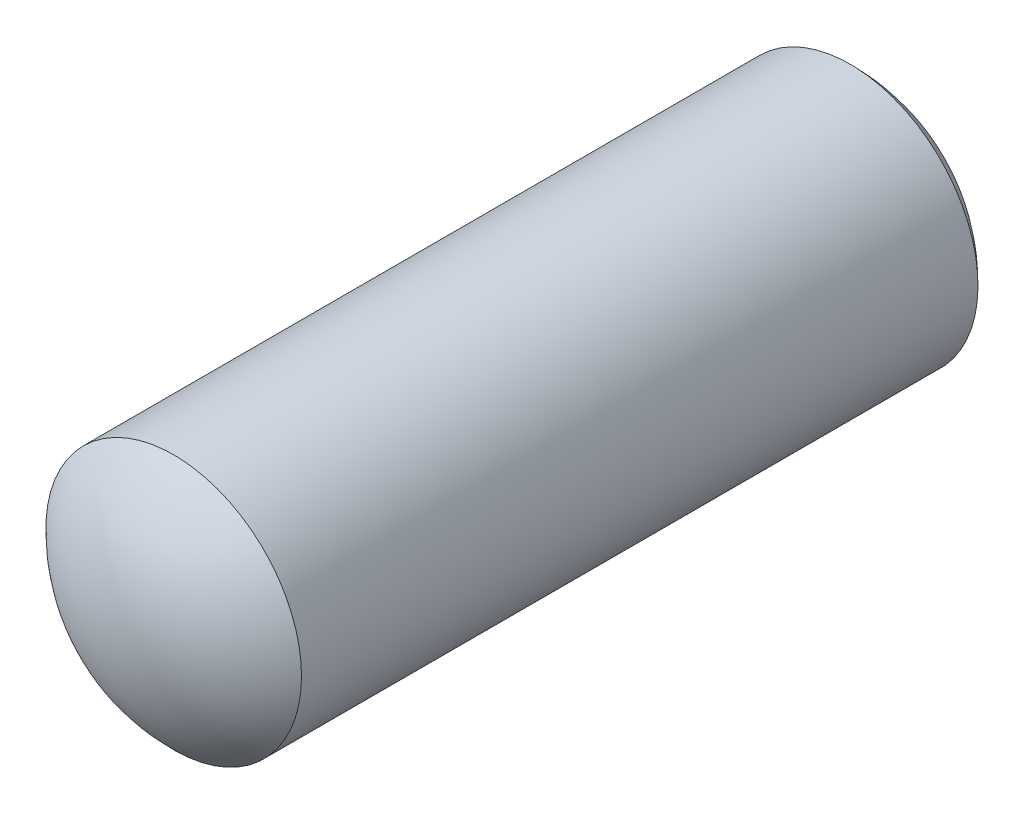
ISO-10303-21;
HEADER;
FILE_DESCRIPTION(('STEP AP214'),'2;1');
FILE_NAME('part.step','',(''),(''),'','','');
FILE_SCHEMA(('AUTOMOTIVE_DESIGN { 1 0 10303 214 1 1 1 1 }'));
ENDSEC;
DATA;
#1=APPLICATION_CONTEXT('core data for automotive mechanical design processes');
#2=APPLICATION_PROTOCOL_DEFINITION('international standard','automotive_design',2000,#1);
#3=PRODUCT_CONTEXT('',#1,'mechanical');
#4=PRODUCT('Part','Part','',(#3));
#5=PRODUCT_RELATED_PRODUCT_CATEGORY('part','',(#4));
#6=PRODUCT_DEFINITION_FORMATION('','',#4);
#7=PRODUCT_DEFINITION_CONTEXT('part definition',#1,'design');
#8=PRODUCT_DEFINITION('design','',#6,#7);
#9=PRODUCT_DEFINITION_SHAPE('','',#8);
#10=(LENGTH_UNIT() NAMED_UNIT(*) SI_UNIT(.MILLI.,.METRE.));
#11=(NAMED_UNIT(*) PLANE_ANGLE_UNIT() SI_UNIT($,.RADIAN.));
#12=(NAMED_UNIT(*) SI_UNIT($,.STERADIAN.) SOLID_ANGLE_UNIT());
#13=UNCERTAINTY_MEASURE_WITH_UNIT(LENGTH_MEASURE(1.E-05),#10,'distance_accuracy_value','');
#14=(GEOMETRIC_REPRESENTATION_CONTEXT(3) GLOBAL_UNCERTAINTY_ASSIGNED_CONTEXT((#13)) GLOBAL_UNIT_ASSIGNED_CONTEXT((#10,
#11,#12)) REPRESENTATION_CONTEXT('',''));
#15=CARTESIAN_POINT('',(0.,0.,0.));
#16=DIRECTION('',(0.,0.,1.));
#17=DIRECTION('',(1.,0.,0.));
#18=AXIS2_PLACEMENT_3D('',#15,#16,#17);
#19=CARTESIAN_POINT('',(9.03212065716355,1.29862289924376,7.875));
#20=DIRECTION('',(0.142314838273285,-0.989821441880933,0.));
#21=DIRECTION('',(0.,0.,1.));
#22=AXIS2_PLACEMENT_3D('',#19,#20,#21);
#23=SPHERICAL_SURFACE('',#22,1.575);
#24=CARTESIAN_POINT('',(9.03212065716355,1.29862289924376,7.875));
#25=DIRECTION('',(0.,0.,1.));
#26=DIRECTION('',(-0.989821441880933,-0.142314838273285,0.));
#27=AXIS2_PLACEMENT_3D('',#24,#25,#26);
#28=SPHERICAL_SURFACE('',#27,1.575);
#29=CARTESIAN_POINT('',(9.03212065716355,1.29862289924376,8.97727038425245));
#30=DIRECTION('',(0.,0.,1.));
#31=DIRECTION('',(-0.989821441880933,-0.142314838273285,0.));
#32=AXIS2_PLACEMENT_3D('',#29,#30,#31);
#33=CIRCLE('',#32,1.125);
#34=CARTESIAN_POINT('',(7.9185715350475,1.13851870618632,8.97727038425245));
#35=VERTEX_POINT('',#34);
#36=EDGE_CURVE('E11',#35,#35,#33,.T.);
#37=ORIENTED_EDGE('',*,*,#36,.T.);
#38=EDGE_LOOP('',(#37));
#39=FACE_BOUND('',#38,.T.);
#40=ADVANCED_FACE('F17',(#39),#28,.T.);
#41=CARTESIAN_POINT('',(9.03212065716355,1.29862289924376,6.));
#42=DIRECTION('',(0.,0.,1.));
#43=DIRECTION('',(-0.989821441880933,-0.142314838273285,0.));
#44=AXIS2_PLACEMENT_3D('',#41,#42,#43);
#45=CYLINDRICAL_SURFACE('',#44,1.125);
#46=CARTESIAN_POINT('',(9.03212065716356,1.29862289924376,3.02272961574759));
#47=DIRECTION('',(0.,0.,1.));
#48=DIRECTION('',(-0.989821441880933,-0.142314838273285,0.));
#49=AXIS2_PLACEMENT_3D('',#46,#47,#48);
#50=CIRCLE('',#49,1.125);
#51=CARTESIAN_POINT('',(7.91857153504751,1.13851870618632,3.02272961574759));
#52=VERTEX_POINT('',#51);
#53=EDGE_CURVE('E27',#52,#52,#50,.T.);
#54=ORIENTED_EDGE('',*,*,#53,.T.);
#55=EDGE_LOOP('',(#54));
#56=FACE_BOUND('',#55,.T.);
#57=ORIENTED_EDGE('',*,*,#36,.F.);
#58=EDGE_LOOP('',(#57));
#59=FACE_BOUND('',#58,.T.);
#60=ADVANCED_FACE('F19',(#56,#59),#45,.T.);
#61=CARTESIAN_POINT('',(9.03212065716355,1.29862289924376,4.125));
#62=DIRECTION('',(0.142314838273285,-0.989821441880933,0.));
#63=DIRECTION('',(0.,0.,-1.));
#64=AXIS2_PLACEMENT_3D('',#61,#62,#63);
#65=SPHERICAL_SURFACE('',#64,1.575);
#66=CARTESIAN_POINT('',(9.03212065716355,1.29862289924376,4.125));
#67=DIRECTION('',(0.,0.,1.));
#68=DIRECTION('',(-0.989821441880933,-0.142314838273285,0.));
#69=AXIS2_PLACEMENT_3D('',#66,#67,#68);
#70=SPHERICAL_SURFACE('',#69,1.575);
#71=ORIENTED_EDGE('',*,*,#53,.F.);
#72=EDGE_LOOP('',(#71));
#73=FACE_BOUND('',#72,.T.);
#74=ADVANCED_FACE('F57',(#73),#70,.T.);
#75=CLOSED_SHELL('',(#40,#60,#74));
#76=MANIFOLD_SOLID_BREP('B1',#75);
#77=ADVANCED_BREP_SHAPE_REPRESENTATION('',(#18,#76),#14);
#78=SHAPE_DEFINITION_REPRESENTATION(#9,#77);
ENDSEC;
END-ISO-10303-21;
